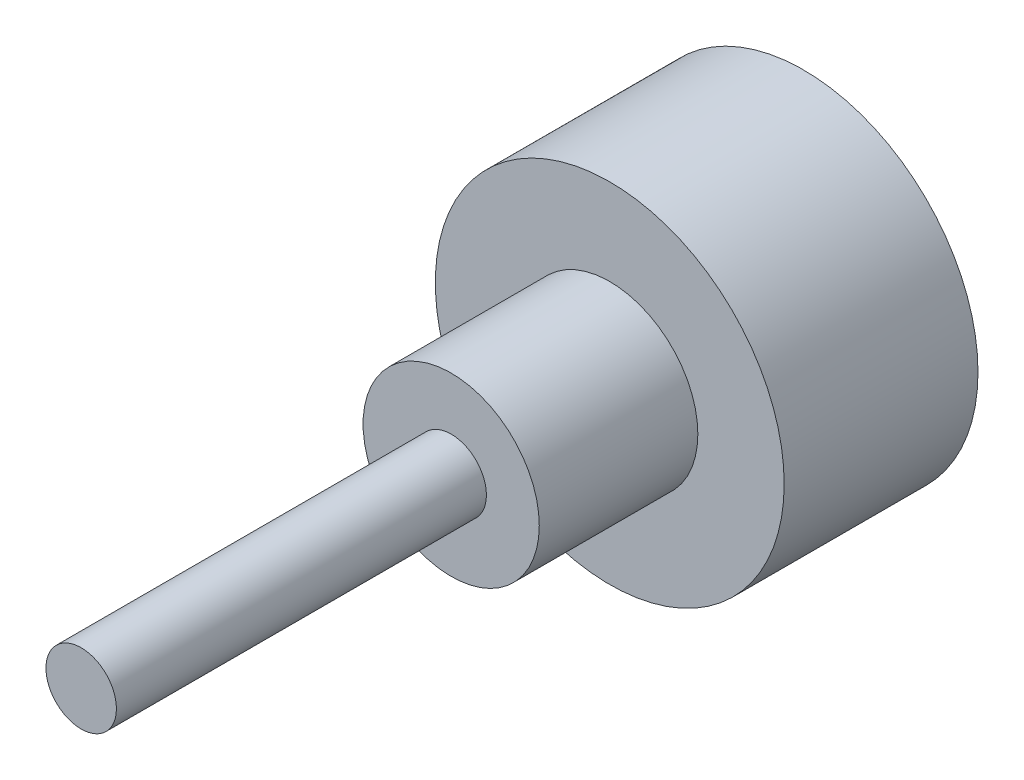
ISO-10303-21;
HEADER;
FILE_DESCRIPTION(('STEP AP214'),'2;1');
FILE_NAME('part.step','',(''),(''),'','','');
FILE_SCHEMA(('AUTOMOTIVE_DESIGN { 1 0 10303 214 1 1 1 1 }'));
ENDSEC;
DATA;
#1=APPLICATION_CONTEXT('core data for automotive mechanical design processes');
#2=APPLICATION_PROTOCOL_DEFINITION('international standard','automotive_design',2000,#1);
#3=PRODUCT_CONTEXT('',#1,'mechanical');
#4=PRODUCT('Part','Part','',(#3));
#5=PRODUCT_RELATED_PRODUCT_CATEGORY('part','',(#4));
#6=PRODUCT_DEFINITION_FORMATION('','',#4);
#7=PRODUCT_DEFINITION_CONTEXT('part definition',#1,'design');
#8=PRODUCT_DEFINITION('design','',#6,#7);
#9=PRODUCT_DEFINITION_SHAPE('','',#8);
#10=(LENGTH_UNIT() NAMED_UNIT(*) SI_UNIT(.MILLI.,.METRE.));
#11=(NAMED_UNIT(*) PLANE_ANGLE_UNIT() SI_UNIT($,.RADIAN.));
#12=(NAMED_UNIT(*) SI_UNIT($,.STERADIAN.) SOLID_ANGLE_UNIT());
#13=UNCERTAINTY_MEASURE_WITH_UNIT(LENGTH_MEASURE(1.E-05),#10,'distance_accuracy_value','');
#14=(GEOMETRIC_REPRESENTATION_CONTEXT(3) GLOBAL_UNCERTAINTY_ASSIGNED_CONTEXT((#13)) GLOBAL_UNIT_ASSIGNED_CONTEXT((#10,
#11,#12)) REPRESENTATION_CONTEXT('',''));
#15=CARTESIAN_POINT('',(0.,0.,0.));
#16=DIRECTION('',(0.,0.,1.));
#17=DIRECTION('',(1.,0.,0.));
#18=AXIS2_PLACEMENT_3D('',#15,#16,#17);
#19=CARTESIAN_POINT('',(0.,0.,0.));
#20=DIRECTION('',(0.,0.,1.));
#21=DIRECTION('',(1.,0.,0.));
#22=AXIS2_PLACEMENT_3D('',#19,#20,#21);
#23=PLANE('',#22);
#24=CARTESIAN_POINT('',(0.,0.,0.));
#25=DIRECTION('',(0.,0.,1.));
#26=DIRECTION('',(1.,0.,0.));
#27=AXIS2_PLACEMENT_3D('',#24,#25,#26);
#28=CIRCLE('',#27,9.9);
#29=CARTESIAN_POINT('',(9.9,0.,0.));
#30=VERTEX_POINT('',#29);
#31=EDGE_CURVE('E10',#30,#30,#28,.T.);
#32=ORIENTED_EDGE('',*,*,#31,.F.);
#33=EDGE_LOOP('',(#32));
#34=FACE_BOUND('',#33,.T.);
#35=CARTESIAN_POINT('',(0.,0.,0.));
#36=DIRECTION('',(0.,0.,1.));
#37=DIRECTION('',(1.,0.,0.));
#38=AXIS2_PLACEMENT_3D('',#35,#36,#37);
#39=CIRCLE('',#38,7.9);
#40=CARTESIAN_POINT('',(7.9,0.,0.));
#41=VERTEX_POINT('',#40);
#42=EDGE_CURVE('E38',#41,#41,#39,.T.);
#43=ORIENTED_EDGE('',*,*,#42,.T.);
#44=EDGE_LOOP('',(#43));
#45=FACE_BOUND('',#44,.T.);
#46=ADVANCED_FACE('F30',(#34,#45),#23,.F.);
#47=CARTESIAN_POINT('',(0.,0.,10.));
#48=DIRECTION('',(0.,0.,-1.));
#49=DIRECTION('',(-1.,0.,0.));
#50=AXIS2_PLACEMENT_3D('',#47,#48,#49);
#51=CYLINDRICAL_SURFACE('',#50,9.9);
#52=ORIENTED_EDGE('',*,*,#31,.T.);
#53=EDGE_LOOP('',(#52));
#54=FACE_BOUND('',#53,.T.);
#55=CARTESIAN_POINT('',(0.,0.,11.));
#56=DIRECTION('',(0.,0.,1.));
#57=DIRECTION('',(1.,0.,0.));
#58=AXIS2_PLACEMENT_3D('',#55,#56,#57);
#59=CIRCLE('',#58,9.9);
#60=CARTESIAN_POINT('',(9.9,0.,11.));
#61=VERTEX_POINT('',#60);
#62=EDGE_CURVE('E47',#61,#61,#59,.T.);
#63=ORIENTED_EDGE('',*,*,#62,.F.);
#64=EDGE_LOOP('',(#63));
#65=FACE_BOUND('',#64,.T.);
#66=ADVANCED_FACE('F32',(#54,#65),#51,.T.);
#67=CARTESIAN_POINT('',(0.,0.,10.));
#68=DIRECTION('',(0.,0.,-1.));
#69=DIRECTION('',(-1.,0.,0.));
#70=AXIS2_PLACEMENT_3D('',#67,#68,#69);
#71=CYLINDRICAL_SURFACE('',#70,7.9);
#72=CARTESIAN_POINT('',(0.,0.,10.));
#73=DIRECTION('',(0.,0.,1.));
#74=DIRECTION('',(1.,0.,0.));
#75=AXIS2_PLACEMENT_3D('',#72,#73,#74);
#76=CIRCLE('',#75,7.9);
#77=CARTESIAN_POINT('',(7.9,0.,10.));
#78=VERTEX_POINT('',#77);
#79=EDGE_CURVE('E42',#78,#78,#76,.T.);
#80=ORIENTED_EDGE('',*,*,#79,.T.);
#81=EDGE_LOOP('',(#80));
#82=FACE_BOUND('',#81,.T.);
#83=ORIENTED_EDGE('',*,*,#42,.F.);
#84=EDGE_LOOP('',(#83));
#85=FACE_BOUND('',#84,.T.);
#86=ADVANCED_FACE('F83',(#82,#85),#71,.F.);
#87=CARTESIAN_POINT('',(0.,0.,10.));
#88=DIRECTION('',(0.,0.,1.));
#89=DIRECTION('',(1.,0.,0.));
#90=AXIS2_PLACEMENT_3D('',#87,#88,#89);
#91=PLANE('',#90);
#92=ORIENTED_EDGE('',*,*,#79,.F.);
#93=EDGE_LOOP('',(#92));
#94=FACE_BOUND('',#93,.T.);
#95=ADVANCED_FACE('F88',(#94),#91,.F.);
#96=CARTESIAN_POINT('',(0.,0.,11.));
#97=DIRECTION('',(0.,0.,1.));
#98=DIRECTION('',(1.,0.,0.));
#99=AXIS2_PLACEMENT_3D('',#96,#97,#98);
#100=PLANE('',#99);
#101=CARTESIAN_POINT('',(0.,0.,11.));
#102=DIRECTION('',(0.,0.,1.));
#103=DIRECTION('',(1.,0.,0.));
#104=AXIS2_PLACEMENT_3D('',#101,#102,#103);
#105=CIRCLE('',#104,5.);
#106=CARTESIAN_POINT('',(5.,0.,11.));
#107=VERTEX_POINT('',#106);
#108=EDGE_CURVE('E51',#107,#107,#105,.T.);
#109=ORIENTED_EDGE('',*,*,#108,.F.);
#110=EDGE_LOOP('',(#109));
#111=FACE_BOUND('',#110,.T.);
#112=ORIENTED_EDGE('',*,*,#62,.T.);
#113=EDGE_LOOP('',(#112));
#114=FACE_BOUND('',#113,.T.);
#115=ADVANCED_FACE('F92',(#111,#114),#100,.T.);
#116=CARTESIAN_POINT('',(0.,0.,20.));
#117=DIRECTION('',(0.,0.,-1.));
#118=DIRECTION('',(-1.,0.,0.));
#119=AXIS2_PLACEMENT_3D('',#116,#117,#118);
#120=CYLINDRICAL_SURFACE('',#119,5.);
#121=CARTESIAN_POINT('',(0.,0.,20.));
#122=DIRECTION('',(0.,0.,1.));
#123=DIRECTION('',(1.,0.,0.));
#124=AXIS2_PLACEMENT_3D('',#121,#122,#123);
#125=CIRCLE('',#124,5.);
#126=CARTESIAN_POINT('',(5.,0.,20.));
#127=VERTEX_POINT('',#126);
#128=EDGE_CURVE('E50',#127,#127,#125,.T.);
#129=ORIENTED_EDGE('',*,*,#128,.F.);
#130=EDGE_LOOP('',(#129));
#131=FACE_BOUND('',#130,.T.);
#132=ORIENTED_EDGE('',*,*,#108,.T.);
#133=EDGE_LOOP('',(#132));
#134=FACE_BOUND('',#133,.T.);
#135=ADVANCED_FACE('F76',(#131,#134),#120,.T.);
#136=CARTESIAN_POINT('',(0.,0.,20.));
#137=DIRECTION('',(0.,0.,1.));
#138=DIRECTION('',(1.,0.,0.));
#139=AXIS2_PLACEMENT_3D('',#136,#137,#138);
#140=PLANE('',#139);
#141=CARTESIAN_POINT('',(0.,0.,20.));
#142=DIRECTION('',(0.,0.,1.));
#143=DIRECTION('',(1.,0.,0.));
#144=AXIS2_PLACEMENT_3D('',#141,#142,#143);
#145=CIRCLE('',#144,2.);
#146=CARTESIAN_POINT('',(2.,0.,20.));
#147=VERTEX_POINT('',#146);
#148=EDGE_CURVE('E34',#147,#147,#145,.F.);
#149=ORIENTED_EDGE('',*,*,#148,.T.);
#150=EDGE_LOOP('',(#149));
#151=FACE_BOUND('',#150,.T.);
#152=ORIENTED_EDGE('',*,*,#128,.T.);
#153=EDGE_LOOP('',(#152));
#154=FACE_BOUND('',#153,.T.);
#155=ADVANCED_FACE('F63',(#151,#154),#140,.T.);
#156=CARTESIAN_POINT('',(0.,0.,41.));
#157=DIRECTION('',(0.,0.,-1.));
#158=DIRECTION('',(-1.,0.,0.));
#159=AXIS2_PLACEMENT_3D('',#156,#157,#158);
#160=CYLINDRICAL_SURFACE('',#159,2.);
#161=ORIENTED_EDGE('',*,*,#148,.F.);
#162=EDGE_LOOP('',(#161));
#163=FACE_BOUND('',#162,.T.);
#164=CARTESIAN_POINT('',(0.,0.,41.));
#165=DIRECTION('',(0.,0.,1.));
#166=DIRECTION('',(1.,0.,0.));
#167=AXIS2_PLACEMENT_3D('',#164,#165,#166);
#168=CIRCLE('',#167,2.);
#169=CARTESIAN_POINT('',(2.,0.,41.));
#170=VERTEX_POINT('',#169);
#171=EDGE_CURVE('E56',#170,#170,#168,.T.);
#172=ORIENTED_EDGE('',*,*,#171,.F.);
#173=EDGE_LOOP('',(#172));
#174=FACE_BOUND('',#173,.T.);
#175=ADVANCED_FACE('F66',(#163,#174),#160,.T.);
#176=CARTESIAN_POINT('',(0.,0.,41.));
#177=DIRECTION('',(0.,0.,1.));
#178=DIRECTION('',(1.,0.,0.));
#179=AXIS2_PLACEMENT_3D('',#176,#177,#178);
#180=PLANE('',#179);
#181=ORIENTED_EDGE('',*,*,#171,.T.);
#182=EDGE_LOOP('',(#181));
#183=FACE_BOUND('',#182,.T.);
#184=ADVANCED_FACE('F69',(#183),#180,.T.);
#185=CLOSED_SHELL('',(#46,#66,#86,#95,#115,#135,#155,#175,#184));
#186=MANIFOLD_SOLID_BREP('B2',#185);
#187=ADVANCED_BREP_SHAPE_REPRESENTATION('',(#18,#186),#14);
#188=SHAPE_DEFINITION_REPRESENTATION(#9,#187);
ENDSEC;
END-ISO-10303-21;
